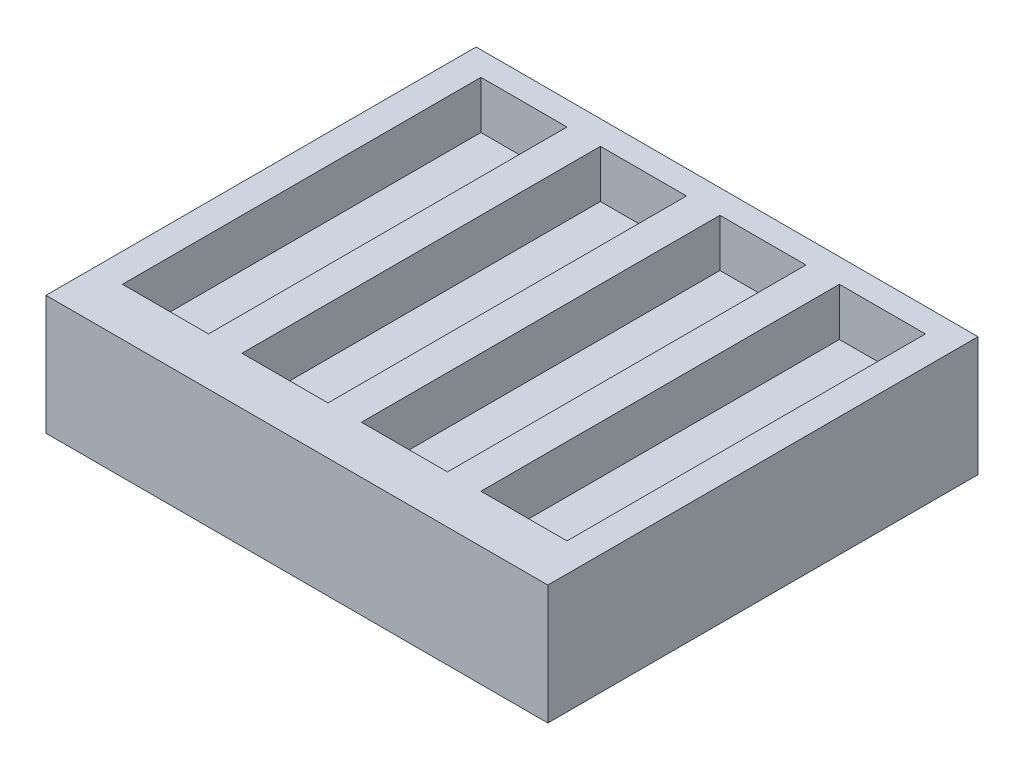
ISO-10303-21;
HEADER;
FILE_DESCRIPTION(('STEP AP214'),'2;1');
FILE_NAME('part.step','',(''),(''),'','','');
FILE_SCHEMA(('AUTOMOTIVE_DESIGN { 1 0 10303 214 1 1 1 1 }'));
ENDSEC;
DATA;
#1=APPLICATION_CONTEXT('core data for automotive mechanical design processes');
#2=APPLICATION_PROTOCOL_DEFINITION('international standard','automotive_design',2000,#1);
#3=PRODUCT_CONTEXT('',#1,'mechanical');
#4=PRODUCT('Part','Part','',(#3));
#5=PRODUCT_RELATED_PRODUCT_CATEGORY('part','',(#4));
#6=PRODUCT_DEFINITION_FORMATION('','',#4);
#7=PRODUCT_DEFINITION_CONTEXT('part definition',#1,'design');
#8=PRODUCT_DEFINITION('design','',#6,#7);
#9=PRODUCT_DEFINITION_SHAPE('','',#8);
#10=(LENGTH_UNIT() NAMED_UNIT(*) SI_UNIT(.MILLI.,.METRE.));
#11=(NAMED_UNIT(*) PLANE_ANGLE_UNIT() SI_UNIT($,.RADIAN.));
#12=(NAMED_UNIT(*) SI_UNIT($,.STERADIAN.) SOLID_ANGLE_UNIT());
#13=UNCERTAINTY_MEASURE_WITH_UNIT(LENGTH_MEASURE(1.E-05),#10,'distance_accuracy_value','');
#14=(GEOMETRIC_REPRESENTATION_CONTEXT(3) GLOBAL_UNCERTAINTY_ASSIGNED_CONTEXT((#13)) GLOBAL_UNIT_ASSIGNED_CONTEXT((#10,
#11,#12)) REPRESENTATION_CONTEXT('',''));
#15=CARTESIAN_POINT('',(0.,0.,0.));
#16=DIRECTION('',(0.,0.,1.));
#17=DIRECTION('',(1.,0.,0.));
#18=AXIS2_PLACEMENT_3D('',#15,#16,#17);
#19=CARTESIAN_POINT('',(52.5,25.,45.));
#20=DIRECTION('',(-1.,0.,0.));
#21=DIRECTION('',(0.,0.,1.));
#22=AXIS2_PLACEMENT_3D('',#19,#20,#21);
#23=PLANE('',#22);
#24=DIRECTION('',(0.,0.,-1.));
#25=VECTOR('',#24,1.);
#26=CARTESIAN_POINT('',(52.5,0.,45.));
#27=LINE('',#26,#25);
#28=CARTESIAN_POINT('',(52.5,0.,45.));
#29=VERTEX_POINT('',#28);
#30=CARTESIAN_POINT('',(52.5,0.,-45.));
#31=VERTEX_POINT('',#30);
#32=EDGE_CURVE('E208',#29,#31,#27,.T.);
#33=ORIENTED_EDGE('',*,*,#32,.T.);
#34=DIRECTION('',(0.,-1.,0.));
#35=VECTOR('',#34,1.);
#36=CARTESIAN_POINT('',(52.5,25.,-45.));
#37=LINE('',#36,#35);
#38=CARTESIAN_POINT('',(52.5,25.,-45.));
#39=VERTEX_POINT('',#38);
#40=EDGE_CURVE('E11',#39,#31,#37,.T.);
#41=ORIENTED_EDGE('',*,*,#40,.F.);
#42=DIRECTION('',(0.,0.,-1.));
#43=VECTOR('',#42,1.);
#44=CARTESIAN_POINT('',(52.5,25.,45.));
#45=LINE('',#44,#43);
#46=CARTESIAN_POINT('',(52.5,25.,45.));
#47=VERTEX_POINT('',#46);
#48=EDGE_CURVE('E306',#47,#39,#45,.T.);
#49=ORIENTED_EDGE('',*,*,#48,.F.);
#50=DIRECTION('',(0.,-1.,0.));
#51=VECTOR('',#50,1.);
#52=CARTESIAN_POINT('',(52.5,25.,45.));
#53=LINE('',#52,#51);
#54=EDGE_CURVE('E316',#47,#29,#53,.T.);
#55=ORIENTED_EDGE('',*,*,#54,.T.);
#56=EDGE_LOOP('',(#33,#41,#49,#55));
#57=FACE_BOUND('',#56,.T.);
#58=ADVANCED_FACE('F37',(#57),#23,.F.);
#59=CARTESIAN_POINT('',(-52.5,25.,-45.));
#60=DIRECTION('',(0.,0.,1.));
#61=DIRECTION('',(1.,0.,0.));
#62=AXIS2_PLACEMENT_3D('',#59,#60,#61);
#63=PLANE('',#62);
#64=DIRECTION('',(-1.,0.,0.));
#65=VECTOR('',#64,1.);
#66=CARTESIAN_POINT('',(-52.5,0.,-45.));
#67=LINE('',#66,#65);
#68=CARTESIAN_POINT('',(-52.5,0.,-45.));
#69=VERTEX_POINT('',#68);
#70=EDGE_CURVE('E319',#31,#69,#67,.T.);
#71=ORIENTED_EDGE('',*,*,#70,.T.);
#72=DIRECTION('',(0.,-1.,0.));
#73=VECTOR('',#72,1.);
#74=CARTESIAN_POINT('',(-52.5,25.,-45.));
#75=LINE('',#74,#73);
#76=CARTESIAN_POINT('',(-52.5,25.,-45.));
#77=VERTEX_POINT('',#76);
#78=EDGE_CURVE('E44',#77,#69,#75,.T.);
#79=ORIENTED_EDGE('',*,*,#78,.F.);
#80=DIRECTION('',(-1.,0.,0.));
#81=VECTOR('',#80,1.);
#82=CARTESIAN_POINT('',(-52.5,25.,-45.));
#83=LINE('',#82,#81);
#84=EDGE_CURVE('E309',#39,#77,#83,.T.);
#85=ORIENTED_EDGE('',*,*,#84,.F.);
#86=ORIENTED_EDGE('',*,*,#40,.T.);
#87=EDGE_LOOP('',(#71,#79,#85,#86));
#88=FACE_BOUND('',#87,.T.);
#89=ADVANCED_FACE('F349',(#88),#63,.F.);
#90=CARTESIAN_POINT('',(-52.5,25.,45.));
#91=DIRECTION('',(1.,0.,0.));
#92=DIRECTION('',(0.,0.,-1.));
#93=AXIS2_PLACEMENT_3D('',#90,#91,#92);
#94=PLANE('',#93);
#95=DIRECTION('',(0.,0.,1.));
#96=VECTOR('',#95,1.);
#97=CARTESIAN_POINT('',(-52.5,0.,45.));
#98=LINE('',#97,#96);
#99=CARTESIAN_POINT('',(-52.5,0.,45.));
#100=VERTEX_POINT('',#99);
#101=EDGE_CURVE('E321',#69,#100,#98,.T.);
#102=ORIENTED_EDGE('',*,*,#101,.T.);
#103=DIRECTION('',(0.,-1.,0.));
#104=VECTOR('',#103,1.);
#105=CARTESIAN_POINT('',(-52.5,25.,45.));
#106=LINE('',#105,#104);
#107=CARTESIAN_POINT('',(-52.5,25.,45.));
#108=VERTEX_POINT('',#107);
#109=EDGE_CURVE('E326',#108,#100,#106,.T.);
#110=ORIENTED_EDGE('',*,*,#109,.F.);
#111=DIRECTION('',(0.,0.,1.));
#112=VECTOR('',#111,1.);
#113=CARTESIAN_POINT('',(-52.5,25.,45.));
#114=LINE('',#113,#112);
#115=EDGE_CURVE('E312',#77,#108,#114,.T.);
#116=ORIENTED_EDGE('',*,*,#115,.F.);
#117=ORIENTED_EDGE('',*,*,#78,.T.);
#118=EDGE_LOOP('',(#102,#110,#116,#117));
#119=FACE_BOUND('',#118,.T.);
#120=ADVANCED_FACE('F333',(#119),#94,.F.);
#121=CARTESIAN_POINT('',(-52.5,25.,45.));
#122=DIRECTION('',(0.,0.,-1.));
#123=DIRECTION('',(-1.,0.,0.));
#124=AXIS2_PLACEMENT_3D('',#121,#122,#123);
#125=PLANE('',#124);
#126=DIRECTION('',(1.,0.,0.));
#127=VECTOR('',#126,1.);
#128=CARTESIAN_POINT('',(-52.5,0.,45.));
#129=LINE('',#128,#127);
#130=EDGE_CURVE('E310',#100,#29,#129,.T.);
#131=ORIENTED_EDGE('',*,*,#130,.T.);
#132=ORIENTED_EDGE('',*,*,#54,.F.);
#133=DIRECTION('',(1.,0.,0.));
#134=VECTOR('',#133,1.);
#135=CARTESIAN_POINT('',(-52.5,25.,45.));
#136=LINE('',#135,#134);
#137=EDGE_CURVE('E314',#108,#47,#136,.T.);
#138=ORIENTED_EDGE('',*,*,#137,.F.);
#139=ORIENTED_EDGE('',*,*,#109,.T.);
#140=EDGE_LOOP('',(#131,#132,#138,#139));
#141=FACE_BOUND('',#140,.T.);
#142=ADVANCED_FACE('F342',(#141),#125,.F.);
#143=CARTESIAN_POINT('',(0.,25.,0.));
#144=DIRECTION('',(0.,-1.,0.));
#145=DIRECTION('',(0.,0.,-1.));
#146=AXIS2_PLACEMENT_3D('',#143,#144,#145);
#147=PLANE('',#146);
#148=DIRECTION('',(1.,0.,0.));
#149=VECTOR('',#148,1.);
#150=CARTESIAN_POINT('',(-46.5,25.,35.));
#151=LINE('',#150,#149);
#152=CARTESIAN_POINT('',(-46.5,25.,35.));
#153=VERTEX_POINT('',#152);
#154=CARTESIAN_POINT('',(-28.5,25.,35.));
#155=VERTEX_POINT('',#154);
#156=EDGE_CURVE('E202',#153,#155,#151,.T.);
#157=ORIENTED_EDGE('',*,*,#156,.F.);
#158=DIRECTION('',(0.,0.,1.));
#159=VECTOR('',#158,1.);
#160=CARTESIAN_POINT('',(-46.5,25.,-40.));
#161=LINE('',#160,#159);
#162=CARTESIAN_POINT('',(-46.5,25.,-40.));
#163=VERTEX_POINT('',#162);
#164=EDGE_CURVE('E51',#163,#153,#161,.T.);
#165=ORIENTED_EDGE('',*,*,#164,.F.);
#166=DIRECTION('',(-1.,0.,0.));
#167=VECTOR('',#166,1.);
#168=CARTESIAN_POINT('',(-46.5,25.,-40.));
#169=LINE('',#168,#167);
#170=CARTESIAN_POINT('',(-28.5,25.,-40.));
#171=VERTEX_POINT('',#170);
#172=EDGE_CURVE('E193',#171,#163,#169,.T.);
#173=ORIENTED_EDGE('',*,*,#172,.F.);
#174=DIRECTION('',(0.,0.,-1.));
#175=VECTOR('',#174,1.);
#176=CARTESIAN_POINT('',(-28.5,25.,-40.));
#177=LINE('',#176,#175);
#178=EDGE_CURVE('E196',#155,#171,#177,.T.);
#179=ORIENTED_EDGE('',*,*,#178,.F.);
#180=EDGE_LOOP('',(#157,#165,#173,#179));
#181=FACE_BOUND('',#180,.T.);
#182=DIRECTION('',(1.,0.,0.));
#183=VECTOR('',#182,1.);
#184=CARTESIAN_POINT('',(-21.5,25.,35.));
#185=LINE('',#184,#183);
#186=CARTESIAN_POINT('',(-21.5,25.,35.));
#187=VERTEX_POINT('',#186);
#188=CARTESIAN_POINT('',(-3.49999999999998,25.,35.));
#189=VERTEX_POINT('',#188);
#190=EDGE_CURVE('E229',#187,#189,#185,.T.);
#191=ORIENTED_EDGE('',*,*,#190,.F.);
#192=DIRECTION('',(0.,0.,1.));
#193=VECTOR('',#192,1.);
#194=CARTESIAN_POINT('',(-21.5,25.,-40.));
#195=LINE('',#194,#193);
#196=CARTESIAN_POINT('',(-21.5,25.,-40.));
#197=VERTEX_POINT('',#196);
#198=EDGE_CURVE('E59',#197,#187,#195,.T.);
#199=ORIENTED_EDGE('',*,*,#198,.F.);
#200=DIRECTION('',(-1.,0.,0.));
#201=VECTOR('',#200,1.);
#202=CARTESIAN_POINT('',(-21.5,25.,-40.));
#203=LINE('',#202,#201);
#204=CARTESIAN_POINT('',(-3.49999999999998,25.,-40.));
#205=VERTEX_POINT('',#204);
#206=EDGE_CURVE('E222',#205,#197,#203,.T.);
#207=ORIENTED_EDGE('',*,*,#206,.F.);
#208=DIRECTION('',(0.,0.,-1.));
#209=VECTOR('',#208,1.);
#210=CARTESIAN_POINT('',(-3.49999999999998,25.,-40.));
#211=LINE('',#210,#209);
#212=EDGE_CURVE('E225',#189,#205,#211,.T.);
#213=ORIENTED_EDGE('',*,*,#212,.F.);
#214=EDGE_LOOP('',(#191,#199,#207,#213));
#215=FACE_BOUND('',#214,.T.);
#216=DIRECTION('',(1.,0.,0.));
#217=VECTOR('',#216,1.);
#218=CARTESIAN_POINT('',(3.50000000000003,25.,35.));
#219=LINE('',#218,#217);
#220=CARTESIAN_POINT('',(3.50000000000003,25.,35.));
#221=VERTEX_POINT('',#220);
#222=CARTESIAN_POINT('',(21.5,25.,35.));
#223=VERTEX_POINT('',#222);
#224=EDGE_CURVE('E261',#221,#223,#219,.T.);
#225=ORIENTED_EDGE('',*,*,#224,.F.);
#226=DIRECTION('',(0.,0.,1.));
#227=VECTOR('',#226,1.);
#228=CARTESIAN_POINT('',(3.50000000000002,25.,-40.));
#229=LINE('',#228,#227);
#230=CARTESIAN_POINT('',(3.50000000000002,25.,-40.));
#231=VERTEX_POINT('',#230);
#232=EDGE_CURVE('E221',#231,#221,#229,.T.);
#233=ORIENTED_EDGE('',*,*,#232,.F.);
#234=DIRECTION('',(-1.,0.,0.));
#235=VECTOR('',#234,1.);
#236=CARTESIAN_POINT('',(3.50000000000002,25.,-40.));
#237=LINE('',#236,#235);
#238=CARTESIAN_POINT('',(21.5,25.,-40.));
#239=VERTEX_POINT('',#238);
#240=EDGE_CURVE('E254',#239,#231,#237,.T.);
#241=ORIENTED_EDGE('',*,*,#240,.F.);
#242=DIRECTION('',(0.,0.,-1.));
#243=VECTOR('',#242,1.);
#244=CARTESIAN_POINT('',(21.5,25.,-40.));
#245=LINE('',#244,#243);
#246=EDGE_CURVE('E257',#223,#239,#245,.T.);
#247=ORIENTED_EDGE('',*,*,#246,.F.);
#248=EDGE_LOOP('',(#225,#233,#241,#247));
#249=FACE_BOUND('',#248,.T.);
#250=DIRECTION('',(1.,0.,0.));
#251=VECTOR('',#250,1.);
#252=CARTESIAN_POINT('',(28.5,25.,35.));
#253=LINE('',#252,#251);
#254=CARTESIAN_POINT('',(28.5,25.,35.));
#255=VERTEX_POINT('',#254);
#256=CARTESIAN_POINT('',(46.5,25.,35.));
#257=VERTEX_POINT('',#256);
#258=EDGE_CURVE('E292',#255,#257,#253,.T.);
#259=ORIENTED_EDGE('',*,*,#258,.F.);
#260=DIRECTION('',(0.,0.,1.));
#261=VECTOR('',#260,1.);
#262=CARTESIAN_POINT('',(28.5,25.,-40.));
#263=LINE('',#262,#261);
#264=CARTESIAN_POINT('',(28.5,25.,-40.));
#265=VERTEX_POINT('',#264);
#266=EDGE_CURVE('E253',#265,#255,#263,.T.);
#267=ORIENTED_EDGE('',*,*,#266,.F.);
#268=DIRECTION('',(-1.,0.,0.));
#269=VECTOR('',#268,1.);
#270=CARTESIAN_POINT('',(28.5,25.,-40.));
#271=LINE('',#270,#269);
#272=CARTESIAN_POINT('',(46.5,25.,-40.));
#273=VERTEX_POINT('',#272);
#274=EDGE_CURVE('E285',#273,#265,#271,.T.);
#275=ORIENTED_EDGE('',*,*,#274,.F.);
#276=DIRECTION('',(0.,0.,-1.));
#277=VECTOR('',#276,1.);
#278=CARTESIAN_POINT('',(46.5,25.,-40.));
#279=LINE('',#278,#277);
#280=EDGE_CURVE('E288',#257,#273,#279,.T.);
#281=ORIENTED_EDGE('',*,*,#280,.F.);
#282=EDGE_LOOP('',(#259,#267,#275,#281));
#283=FACE_BOUND('',#282,.T.);
#284=ORIENTED_EDGE('',*,*,#48,.T.);
#285=ORIENTED_EDGE('',*,*,#84,.T.);
#286=ORIENTED_EDGE('',*,*,#115,.T.);
#287=ORIENTED_EDGE('',*,*,#137,.T.);
#288=EDGE_LOOP('',(#284,#285,#286,#287));
#289=FACE_BOUND('',#288,.T.);
#290=ADVANCED_FACE('F348',(#181,#215,#249,#283,#289),#147,.F.);
#291=CARTESIAN_POINT('',(0.,0.,0.));
#292=DIRECTION('',(0.,-1.,0.));
#293=DIRECTION('',(0.,0.,-1.));
#294=AXIS2_PLACEMENT_3D('',#291,#292,#293);
#295=PLANE('',#294);
#296=ORIENTED_EDGE('',*,*,#32,.F.);
#297=ORIENTED_EDGE('',*,*,#130,.F.);
#298=ORIENTED_EDGE('',*,*,#101,.F.);
#299=ORIENTED_EDGE('',*,*,#70,.F.);
#300=EDGE_LOOP('',(#296,#297,#298,#299));
#301=FACE_BOUND('',#300,.T.);
#302=ADVANCED_FACE('F339',(#301),#295,.T.);
#303=CARTESIAN_POINT('',(28.5,15.,-40.));
#304=DIRECTION('',(-1.,0.,0.));
#305=DIRECTION('',(0.,0.,1.));
#306=AXIS2_PLACEMENT_3D('',#303,#304,#305);
#307=PLANE('',#306);
#308=ORIENTED_EDGE('',*,*,#266,.T.);
#309=DIRECTION('',(0.,1.,0.));
#310=VECTOR('',#309,1.);
#311=CARTESIAN_POINT('',(28.5,15.,35.));
#312=LINE('',#311,#310);
#313=CARTESIAN_POINT('',(28.5,15.,35.));
#314=VERTEX_POINT('',#313);
#315=EDGE_CURVE('E275',#314,#255,#312,.T.);
#316=ORIENTED_EDGE('',*,*,#315,.F.);
#317=DIRECTION('',(0.,0.,1.));
#318=VECTOR('',#317,1.);
#319=CARTESIAN_POINT('',(28.5,15.,-40.));
#320=LINE('',#319,#318);
#321=CARTESIAN_POINT('',(28.5,15.,-40.));
#322=VERTEX_POINT('',#321);
#323=EDGE_CURVE('E289',#322,#314,#320,.T.);
#324=ORIENTED_EDGE('',*,*,#323,.F.);
#325=DIRECTION('',(0.,1.,0.));
#326=VECTOR('',#325,1.);
#327=CARTESIAN_POINT('',(28.5,15.,-40.));
#328=LINE('',#327,#326);
#329=EDGE_CURVE('E283',#322,#265,#328,.T.);
#330=ORIENTED_EDGE('',*,*,#329,.T.);
#331=EDGE_LOOP('',(#308,#316,#324,#330));
#332=FACE_BOUND('',#331,.T.);
#333=ADVANCED_FACE('F361',(#332),#307,.F.);
#334=CARTESIAN_POINT('',(28.5,15.,-40.));
#335=DIRECTION('',(0.,0.,-1.));
#336=DIRECTION('',(-1.,0.,0.));
#337=AXIS2_PLACEMENT_3D('',#334,#335,#336);
#338=PLANE('',#337);
#339=ORIENTED_EDGE('',*,*,#274,.T.);
#340=ORIENTED_EDGE('',*,*,#329,.F.);
#341=DIRECTION('',(-1.,0.,0.));
#342=VECTOR('',#341,1.);
#343=CARTESIAN_POINT('',(28.5,15.,-40.));
#344=LINE('',#343,#342);
#345=CARTESIAN_POINT('',(46.5,15.,-40.));
#346=VERTEX_POINT('',#345);
#347=EDGE_CURVE('E278',#346,#322,#344,.T.);
#348=ORIENTED_EDGE('',*,*,#347,.F.);
#349=DIRECTION('',(0.,1.,0.));
#350=VECTOR('',#349,1.);
#351=CARTESIAN_POINT('',(46.5,15.,-40.));
#352=LINE('',#351,#350);
#353=EDGE_CURVE('E281',#346,#273,#352,.T.);
#354=ORIENTED_EDGE('',*,*,#353,.T.);
#355=EDGE_LOOP('',(#339,#340,#348,#354));
#356=FACE_BOUND('',#355,.T.);
#357=ADVANCED_FACE('F371',(#356),#338,.F.);
#358=CARTESIAN_POINT('',(46.5,15.,-40.));
#359=DIRECTION('',(1.,0.,0.));
#360=DIRECTION('',(0.,0.,-1.));
#361=AXIS2_PLACEMENT_3D('',#358,#359,#360);
#362=PLANE('',#361);
#363=ORIENTED_EDGE('',*,*,#280,.T.);
#364=ORIENTED_EDGE('',*,*,#353,.F.);
#365=DIRECTION('',(0.,0.,-1.));
#366=VECTOR('',#365,1.);
#367=CARTESIAN_POINT('',(46.5,15.,-40.));
#368=LINE('',#367,#366);
#369=CARTESIAN_POINT('',(46.5,15.,35.));
#370=VERTEX_POINT('',#369);
#371=EDGE_CURVE('E298',#370,#346,#368,.T.);
#372=ORIENTED_EDGE('',*,*,#371,.F.);
#373=DIRECTION('',(0.,1.,0.));
#374=VECTOR('',#373,1.);
#375=CARTESIAN_POINT('',(46.5,15.,35.));
#376=LINE('',#375,#374);
#377=EDGE_CURVE('E279',#370,#257,#376,.T.);
#378=ORIENTED_EDGE('',*,*,#377,.T.);
#379=EDGE_LOOP('',(#363,#364,#372,#378));
#380=FACE_BOUND('',#379,.T.);
#381=ADVANCED_FACE('F374',(#380),#362,.F.);
#382=CARTESIAN_POINT('',(28.5,15.,35.));
#383=DIRECTION('',(0.,0.,1.));
#384=DIRECTION('',(1.,0.,0.));
#385=AXIS2_PLACEMENT_3D('',#382,#383,#384);
#386=PLANE('',#385);
#387=ORIENTED_EDGE('',*,*,#258,.T.);
#388=ORIENTED_EDGE('',*,*,#377,.F.);
#389=DIRECTION('',(1.,0.,0.));
#390=VECTOR('',#389,1.);
#391=CARTESIAN_POINT('',(28.5,15.,35.));
#392=LINE('',#391,#390);
#393=EDGE_CURVE('E301',#314,#370,#392,.T.);
#394=ORIENTED_EDGE('',*,*,#393,.F.);
#395=ORIENTED_EDGE('',*,*,#315,.T.);
#396=EDGE_LOOP('',(#387,#388,#394,#395));
#397=FACE_BOUND('',#396,.T.);
#398=ADVANCED_FACE('F369',(#397),#386,.F.);
#399=CARTESIAN_POINT('',(0.,15.,0.));
#400=DIRECTION('',(0.,1.,0.));
#401=DIRECTION('',(0.,0.,1.));
#402=AXIS2_PLACEMENT_3D('',#399,#400,#401);
#403=PLANE('',#402);
#404=ORIENTED_EDGE('',*,*,#323,.T.);
#405=ORIENTED_EDGE('',*,*,#393,.T.);
#406=ORIENTED_EDGE('',*,*,#371,.T.);
#407=ORIENTED_EDGE('',*,*,#347,.T.);
#408=EDGE_LOOP('',(#404,#405,#406,#407));
#409=FACE_BOUND('',#408,.T.);
#410=ADVANCED_FACE('F365',(#409),#403,.T.);
#411=CARTESIAN_POINT('',(3.50000000000002,15.,-40.));
#412=DIRECTION('',(-1.,0.,0.));
#413=DIRECTION('',(0.,0.,1.));
#414=AXIS2_PLACEMENT_3D('',#411,#412,#413);
#415=PLANE('',#414);
#416=ORIENTED_EDGE('',*,*,#232,.T.);
#417=DIRECTION('',(0.,1.,0.));
#418=VECTOR('',#417,1.);
#419=CARTESIAN_POINT('',(3.50000000000003,15.,35.));
#420=LINE('',#419,#418);
#421=CARTESIAN_POINT('',(3.50000000000003,15.,35.));
#422=VERTEX_POINT('',#421);
#423=EDGE_CURVE('E243',#422,#221,#420,.T.);
#424=ORIENTED_EDGE('',*,*,#423,.F.);
#425=DIRECTION('',(0.,0.,1.));
#426=VECTOR('',#425,1.);
#427=CARTESIAN_POINT('',(3.50000000000002,15.,-40.));
#428=LINE('',#427,#426);
#429=CARTESIAN_POINT('',(3.50000000000002,15.,-40.));
#430=VERTEX_POINT('',#429);
#431=EDGE_CURVE('E258',#430,#422,#428,.T.);
#432=ORIENTED_EDGE('',*,*,#431,.F.);
#433=DIRECTION('',(0.,1.,0.));
#434=VECTOR('',#433,1.);
#435=CARTESIAN_POINT('',(3.50000000000002,15.,-40.));
#436=LINE('',#435,#434);
#437=EDGE_CURVE('E251',#430,#231,#436,.T.);
#438=ORIENTED_EDGE('',*,*,#437,.T.);
#439=EDGE_LOOP('',(#416,#424,#432,#438));
#440=FACE_BOUND('',#439,.T.);
#441=ADVANCED_FACE('F368',(#440),#415,.F.);
#442=CARTESIAN_POINT('',(3.50000000000002,15.,-40.));
#443=DIRECTION('',(0.,0.,-1.));
#444=DIRECTION('',(-1.,0.,0.));
#445=AXIS2_PLACEMENT_3D('',#442,#443,#444);
#446=PLANE('',#445);
#447=ORIENTED_EDGE('',*,*,#240,.T.);
#448=ORIENTED_EDGE('',*,*,#437,.F.);
#449=DIRECTION('',(-1.,0.,0.));
#450=VECTOR('',#449,1.);
#451=CARTESIAN_POINT('',(3.50000000000002,15.,-40.));
#452=LINE('',#451,#450);
#453=CARTESIAN_POINT('',(21.5,15.,-40.));
#454=VERTEX_POINT('',#453);
#455=EDGE_CURVE('E246',#454,#430,#452,.T.);
#456=ORIENTED_EDGE('',*,*,#455,.F.);
#457=DIRECTION('',(0.,1.,0.));
#458=VECTOR('',#457,1.);
#459=CARTESIAN_POINT('',(21.5,15.,-40.));
#460=LINE('',#459,#458);
#461=EDGE_CURVE('E249',#454,#239,#460,.T.);
#462=ORIENTED_EDGE('',*,*,#461,.T.);
#463=EDGE_LOOP('',(#447,#448,#456,#462));
#464=FACE_BOUND('',#463,.T.);
#465=ADVANCED_FACE('F391',(#464),#446,.F.);
#466=CARTESIAN_POINT('',(21.5,15.,-40.));
#467=DIRECTION('',(1.,0.,0.));
#468=DIRECTION('',(0.,0.,-1.));
#469=AXIS2_PLACEMENT_3D('',#466,#467,#468);
#470=PLANE('',#469);
#471=ORIENTED_EDGE('',*,*,#246,.T.);
#472=ORIENTED_EDGE('',*,*,#461,.F.);
#473=DIRECTION('',(0.,0.,-1.));
#474=VECTOR('',#473,1.);
#475=CARTESIAN_POINT('',(21.5,15.,-40.));
#476=LINE('',#475,#474);
#477=CARTESIAN_POINT('',(21.5,15.,35.));
#478=VERTEX_POINT('',#477);
#479=EDGE_CURVE('E267',#478,#454,#476,.T.);
#480=ORIENTED_EDGE('',*,*,#479,.F.);
#481=DIRECTION('',(0.,1.,0.));
#482=VECTOR('',#481,1.);
#483=CARTESIAN_POINT('',(21.5,15.,35.));
#484=LINE('',#483,#482);
#485=EDGE_CURVE('E247',#478,#223,#484,.T.);
#486=ORIENTED_EDGE('',*,*,#485,.T.);
#487=EDGE_LOOP('',(#471,#472,#480,#486));
#488=FACE_BOUND('',#487,.T.);
#489=ADVANCED_FACE('F394',(#488),#470,.F.);
#490=CARTESIAN_POINT('',(3.50000000000003,15.,35.));
#491=DIRECTION('',(0.,0.,1.));
#492=DIRECTION('',(1.,0.,0.));
#493=AXIS2_PLACEMENT_3D('',#490,#491,#492);
#494=PLANE('',#493);
#495=ORIENTED_EDGE('',*,*,#224,.T.);
#496=ORIENTED_EDGE('',*,*,#485,.F.);
#497=DIRECTION('',(1.,0.,0.));
#498=VECTOR('',#497,1.);
#499=CARTESIAN_POINT('',(3.50000000000003,15.,35.));
#500=LINE('',#499,#498);
#501=EDGE_CURVE('E270',#422,#478,#500,.T.);
#502=ORIENTED_EDGE('',*,*,#501,.F.);
#503=ORIENTED_EDGE('',*,*,#423,.T.);
#504=EDGE_LOOP('',(#495,#496,#502,#503));
#505=FACE_BOUND('',#504,.T.);
#506=ADVANCED_FACE('F389',(#505),#494,.F.);
#507=CARTESIAN_POINT('',(0.,15.,0.));
#508=DIRECTION('',(0.,1.,0.));
#509=DIRECTION('',(0.,0.,1.));
#510=AXIS2_PLACEMENT_3D('',#507,#508,#509);
#511=PLANE('',#510);
#512=ORIENTED_EDGE('',*,*,#431,.T.);
#513=ORIENTED_EDGE('',*,*,#501,.T.);
#514=ORIENTED_EDGE('',*,*,#479,.T.);
#515=ORIENTED_EDGE('',*,*,#455,.T.);
#516=EDGE_LOOP('',(#512,#513,#514,#515));
#517=FACE_BOUND('',#516,.T.);
#518=ADVANCED_FACE('F385',(#517),#511,.T.);
#519=CARTESIAN_POINT('',(-21.5,15.,-40.));
#520=DIRECTION('',(-1.,0.,0.));
#521=DIRECTION('',(0.,0.,1.));
#522=AXIS2_PLACEMENT_3D('',#519,#520,#521);
#523=PLANE('',#522);
#524=ORIENTED_EDGE('',*,*,#198,.T.);
#525=DIRECTION('',(0.,1.,0.));
#526=VECTOR('',#525,1.);
#527=CARTESIAN_POINT('',(-21.5,15.,35.));
#528=LINE('',#527,#526);
#529=CARTESIAN_POINT('',(-21.5,15.,35.));
#530=VERTEX_POINT('',#529);
#531=EDGE_CURVE('E212',#530,#187,#528,.T.);
#532=ORIENTED_EDGE('',*,*,#531,.F.);
#533=DIRECTION('',(0.,0.,1.));
#534=VECTOR('',#533,1.);
#535=CARTESIAN_POINT('',(-21.5,15.,-40.));
#536=LINE('',#535,#534);
#537=CARTESIAN_POINT('',(-21.5,15.,-40.));
#538=VERTEX_POINT('',#537);
#539=EDGE_CURVE('E226',#538,#530,#536,.T.);
#540=ORIENTED_EDGE('',*,*,#539,.F.);
#541=DIRECTION('',(0.,1.,0.));
#542=VECTOR('',#541,1.);
#543=CARTESIAN_POINT('',(-21.5,15.,-40.));
#544=LINE('',#543,#542);
#545=EDGE_CURVE('E219',#538,#197,#544,.T.);
#546=ORIENTED_EDGE('',*,*,#545,.T.);
#547=EDGE_LOOP('',(#524,#532,#540,#546));
#548=FACE_BOUND('',#547,.T.);
#549=ADVANCED_FACE('F388',(#548),#523,.F.);
#550=CARTESIAN_POINT('',(-21.5,15.,-40.));
#551=DIRECTION('',(0.,0.,-1.));
#552=DIRECTION('',(-1.,0.,0.));
#553=AXIS2_PLACEMENT_3D('',#550,#551,#552);
#554=PLANE('',#553);
#555=ORIENTED_EDGE('',*,*,#206,.T.);
#556=ORIENTED_EDGE('',*,*,#545,.F.);
#557=DIRECTION('',(-1.,0.,0.));
#558=VECTOR('',#557,1.);
#559=CARTESIAN_POINT('',(-21.5,15.,-40.));
#560=LINE('',#559,#558);
#561=CARTESIAN_POINT('',(-3.49999999999998,15.,-40.));
#562=VERTEX_POINT('',#561);
#563=EDGE_CURVE('E214',#562,#538,#560,.T.);
#564=ORIENTED_EDGE('',*,*,#563,.F.);
#565=DIRECTION('',(0.,1.,0.));
#566=VECTOR('',#565,1.);
#567=CARTESIAN_POINT('',(-3.49999999999998,15.,-40.));
#568=LINE('',#567,#566);
#569=EDGE_CURVE('E217',#562,#205,#568,.T.);
#570=ORIENTED_EDGE('',*,*,#569,.T.);
#571=EDGE_LOOP('',(#555,#556,#564,#570));
#572=FACE_BOUND('',#571,.T.);
#573=ADVANCED_FACE('F410',(#572),#554,.F.);
#574=CARTESIAN_POINT('',(-3.49999999999998,15.,-40.));
#575=DIRECTION('',(1.,0.,0.));
#576=DIRECTION('',(0.,0.,-1.));
#577=AXIS2_PLACEMENT_3D('',#574,#575,#576);
#578=PLANE('',#577);
#579=ORIENTED_EDGE('',*,*,#212,.T.);
#580=ORIENTED_EDGE('',*,*,#569,.F.);
#581=DIRECTION('',(0.,0.,-1.));
#582=VECTOR('',#581,1.);
#583=CARTESIAN_POINT('',(-3.49999999999998,15.,-40.));
#584=LINE('',#583,#582);
#585=CARTESIAN_POINT('',(-3.49999999999998,15.,35.));
#586=VERTEX_POINT('',#585);
#587=EDGE_CURVE('E235',#586,#562,#584,.T.);
#588=ORIENTED_EDGE('',*,*,#587,.F.);
#589=DIRECTION('',(0.,1.,0.));
#590=VECTOR('',#589,1.);
#591=CARTESIAN_POINT('',(-3.49999999999998,15.,35.));
#592=LINE('',#591,#590);
#593=EDGE_CURVE('E215',#586,#189,#592,.T.);
#594=ORIENTED_EDGE('',*,*,#593,.T.);
#595=EDGE_LOOP('',(#579,#580,#588,#594));
#596=FACE_BOUND('',#595,.T.);
#597=ADVANCED_FACE('F413',(#596),#578,.F.);
#598=CARTESIAN_POINT('',(-21.5,15.,35.));
#599=DIRECTION('',(0.,0.,1.));
#600=DIRECTION('',(1.,0.,0.));
#601=AXIS2_PLACEMENT_3D('',#598,#599,#600);
#602=PLANE('',#601);
#603=ORIENTED_EDGE('',*,*,#190,.T.);
#604=ORIENTED_EDGE('',*,*,#593,.F.);
#605=DIRECTION('',(1.,0.,0.));
#606=VECTOR('',#605,1.);
#607=CARTESIAN_POINT('',(-21.5,15.,35.));
#608=LINE('',#607,#606);
#609=EDGE_CURVE('E238',#530,#586,#608,.T.);
#610=ORIENTED_EDGE('',*,*,#609,.F.);
#611=ORIENTED_EDGE('',*,*,#531,.T.);
#612=EDGE_LOOP('',(#603,#604,#610,#611));
#613=FACE_BOUND('',#612,.T.);
#614=ADVANCED_FACE('F408',(#613),#602,.F.);
#615=CARTESIAN_POINT('',(0.,15.,0.));
#616=DIRECTION('',(0.,1.,0.));
#617=DIRECTION('',(0.,0.,1.));
#618=AXIS2_PLACEMENT_3D('',#615,#616,#617);
#619=PLANE('',#618);
#620=ORIENTED_EDGE('',*,*,#539,.T.);
#621=ORIENTED_EDGE('',*,*,#609,.T.);
#622=ORIENTED_EDGE('',*,*,#587,.T.);
#623=ORIENTED_EDGE('',*,*,#563,.T.);
#624=EDGE_LOOP('',(#620,#621,#622,#623));
#625=FACE_BOUND('',#624,.T.);
#626=ADVANCED_FACE('F405',(#625),#619,.T.);
#627=CARTESIAN_POINT('',(-46.5,15.,-40.));
#628=DIRECTION('',(-1.,0.,0.));
#629=DIRECTION('',(0.,0.,1.));
#630=AXIS2_PLACEMENT_3D('',#627,#628,#629);
#631=PLANE('',#630);
#632=ORIENTED_EDGE('',*,*,#164,.T.);
#633=DIRECTION('',(0.,1.,0.));
#634=VECTOR('',#633,1.);
#635=CARTESIAN_POINT('',(-46.5,15.,35.));
#636=LINE('',#635,#634);
#637=CARTESIAN_POINT('',(-46.5,15.,35.));
#638=VERTEX_POINT('',#637);
#639=EDGE_CURVE('E171',#638,#153,#636,.T.);
#640=ORIENTED_EDGE('',*,*,#639,.F.);
#641=DIRECTION('',(0.,0.,1.));
#642=VECTOR('',#641,1.);
#643=CARTESIAN_POINT('',(-46.5,15.,-40.));
#644=LINE('',#643,#642);
#645=CARTESIAN_POINT('',(-46.5,15.,-40.));
#646=VERTEX_POINT('',#645);
#647=EDGE_CURVE('E175',#646,#638,#644,.T.);
#648=ORIENTED_EDGE('',*,*,#647,.F.);
#649=DIRECTION('',(0.,1.,0.));
#650=VECTOR('',#649,1.);
#651=CARTESIAN_POINT('',(-46.5,15.,-40.));
#652=LINE('',#651,#650);
#653=EDGE_CURVE('E206',#646,#163,#652,.T.);
#654=ORIENTED_EDGE('',*,*,#653,.T.);
#655=EDGE_LOOP('',(#632,#640,#648,#654));
#656=FACE_BOUND('',#655,.T.);
#657=ADVANCED_FACE('F173',(#656),#631,.F.);
#658=CARTESIAN_POINT('',(-46.5,15.,-40.));
#659=DIRECTION('',(0.,0.,-1.));
#660=DIRECTION('',(-1.,0.,0.));
#661=AXIS2_PLACEMENT_3D('',#658,#659,#660);
#662=PLANE('',#661);
#663=ORIENTED_EDGE('',*,*,#172,.T.);
#664=ORIENTED_EDGE('',*,*,#653,.F.);
#665=DIRECTION('',(-1.,0.,0.));
#666=VECTOR('',#665,1.);
#667=CARTESIAN_POINT('',(-46.5,15.,-40.));
#668=LINE('',#667,#666);
#669=CARTESIAN_POINT('',(-28.5,15.,-40.));
#670=VERTEX_POINT('',#669);
#671=EDGE_CURVE('E181',#670,#646,#668,.T.);
#672=ORIENTED_EDGE('',*,*,#671,.F.);
#673=DIRECTION('',(0.,1.,0.));
#674=VECTOR('',#673,1.);
#675=CARTESIAN_POINT('',(-28.5,15.,-40.));
#676=LINE('',#675,#674);
#677=EDGE_CURVE('E209',#670,#171,#676,.T.);
#678=ORIENTED_EDGE('',*,*,#677,.T.);
#679=EDGE_LOOP('',(#663,#664,#672,#678));
#680=FACE_BOUND('',#679,.T.);
#681=ADVANCED_FACE('F425',(#680),#662,.F.);
#682=CARTESIAN_POINT('',(-28.5,15.,-40.));
#683=DIRECTION('',(1.,0.,0.));
#684=DIRECTION('',(0.,0.,-1.));
#685=AXIS2_PLACEMENT_3D('',#682,#683,#684);
#686=PLANE('',#685);
#687=ORIENTED_EDGE('',*,*,#178,.T.);
#688=ORIENTED_EDGE('',*,*,#677,.F.);
#689=DIRECTION('',(0.,0.,-1.));
#690=VECTOR('',#689,1.);
#691=CARTESIAN_POINT('',(-28.5,15.,-40.));
#692=LINE('',#691,#690);
#693=CARTESIAN_POINT('',(-28.5,15.,35.));
#694=VERTEX_POINT('',#693);
#695=EDGE_CURVE('E189',#694,#670,#692,.T.);
#696=ORIENTED_EDGE('',*,*,#695,.F.);
#697=DIRECTION('',(0.,1.,0.));
#698=VECTOR('',#697,1.);
#699=CARTESIAN_POINT('',(-28.5,15.,35.));
#700=LINE('',#699,#698);
#701=EDGE_CURVE('E180',#694,#155,#700,.T.);
#702=ORIENTED_EDGE('',*,*,#701,.T.);
#703=EDGE_LOOP('',(#687,#688,#696,#702));
#704=FACE_BOUND('',#703,.T.);
#705=ADVANCED_FACE('F428',(#704),#686,.F.);
#706=CARTESIAN_POINT('',(-46.5,15.,35.));
#707=DIRECTION('',(0.,0.,1.));
#708=DIRECTION('',(1.,0.,0.));
#709=AXIS2_PLACEMENT_3D('',#706,#707,#708);
#710=PLANE('',#709);
#711=ORIENTED_EDGE('',*,*,#156,.T.);
#712=ORIENTED_EDGE('',*,*,#701,.F.);
#713=DIRECTION('',(1.,0.,0.));
#714=VECTOR('',#713,1.);
#715=CARTESIAN_POINT('',(-46.5,15.,35.));
#716=LINE('',#715,#714);
#717=EDGE_CURVE('E184',#638,#694,#716,.T.);
#718=ORIENTED_EDGE('',*,*,#717,.F.);
#719=ORIENTED_EDGE('',*,*,#639,.T.);
#720=EDGE_LOOP('',(#711,#712,#718,#719));
#721=FACE_BOUND('',#720,.T.);
#722=ADVANCED_FACE('F185',(#721),#710,.F.);
#723=CARTESIAN_POINT('',(0.,15.,0.));
#724=DIRECTION('',(0.,1.,0.));
#725=DIRECTION('',(0.,0.,1.));
#726=AXIS2_PLACEMENT_3D('',#723,#724,#725);
#727=PLANE('',#726);
#728=ORIENTED_EDGE('',*,*,#647,.T.);
#729=ORIENTED_EDGE('',*,*,#717,.T.);
#730=ORIENTED_EDGE('',*,*,#695,.T.);
#731=ORIENTED_EDGE('',*,*,#671,.T.);
#732=EDGE_LOOP('',(#728,#729,#730,#731));
#733=FACE_BOUND('',#732,.T.);
#734=ADVANCED_FACE('F191',(#733),#727,.T.);
#735=CLOSED_SHELL('',(#58,#89,#120,#142,#290,#302,#333,#357,#381,#398,#410,#441,#465,#489,#506,
#518,#549,#573,#597,#614,#626,#657,#681,#705,#722,#734));
#736=MANIFOLD_SOLID_BREP('B2',#735);
#737=ADVANCED_BREP_SHAPE_REPRESENTATION('',(#18,#736),#14);
#738=SHAPE_DEFINITION_REPRESENTATION(#9,#737);
ENDSEC;
END-ISO-10303-21;
